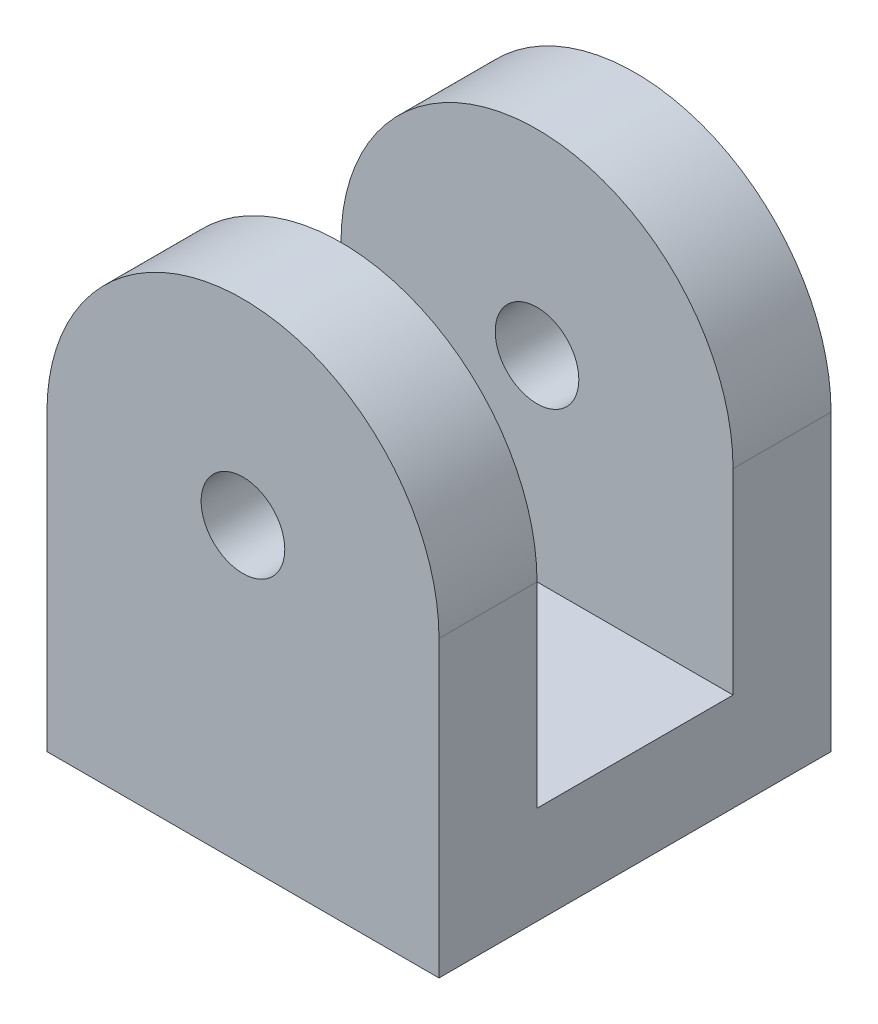
ISO-10303-21;
HEADER;
FILE_DESCRIPTION(('STEP AP214'),'2;1');
FILE_NAME('part.step','',(''),(''),'','','');
FILE_SCHEMA(('AUTOMOTIVE_DESIGN { 1 0 10303 214 1 1 1 1 }'));
ENDSEC;
DATA;
#1=APPLICATION_CONTEXT('core data for automotive mechanical design processes');
#2=APPLICATION_PROTOCOL_DEFINITION('international standard','automotive_design',2000,#1);
#3=PRODUCT_CONTEXT('',#1,'mechanical');
#4=PRODUCT('Part','Part','',(#3));
#5=PRODUCT_RELATED_PRODUCT_CATEGORY('part','',(#4));
#6=PRODUCT_DEFINITION_FORMATION('','',#4);
#7=PRODUCT_DEFINITION_CONTEXT('part definition',#1,'design');
#8=PRODUCT_DEFINITION('design','',#6,#7);
#9=PRODUCT_DEFINITION_SHAPE('','',#8);
#10=(LENGTH_UNIT() NAMED_UNIT(*) SI_UNIT(.MILLI.,.METRE.));
#11=(NAMED_UNIT(*) PLANE_ANGLE_UNIT() SI_UNIT($,.RADIAN.));
#12=(NAMED_UNIT(*) SI_UNIT($,.STERADIAN.) SOLID_ANGLE_UNIT());
#13=UNCERTAINTY_MEASURE_WITH_UNIT(LENGTH_MEASURE(1.E-05),#10,'distance_accuracy_value','');
#14=(GEOMETRIC_REPRESENTATION_CONTEXT(3) GLOBAL_UNCERTAINTY_ASSIGNED_CONTEXT((#13)) GLOBAL_UNIT_ASSIGNED_CONTEXT((#10,
#11,#12)) REPRESENTATION_CONTEXT('',''));
#15=CARTESIAN_POINT('',(0.,0.,0.));
#16=DIRECTION('',(0.,0.,1.));
#17=DIRECTION('',(1.,0.,0.));
#18=AXIS2_PLACEMENT_3D('',#15,#16,#17);
#19=CARTESIAN_POINT('',(0.,0.,7.5));
#20=DIRECTION('',(0.,0.,-1.));
#21=DIRECTION('',(-1.,0.,0.));
#22=AXIS2_PLACEMENT_3D('',#19,#20,#21);
#23=PLANE('',#22);
#24=CARTESIAN_POINT('',(0.,9.375,7.5));
#25=DIRECTION('',(0.,0.,-1.));
#26=DIRECTION('',(-1.,0.,0.));
#27=AXIS2_PLACEMENT_3D('',#24,#25,#26);
#28=CIRCLE('',#27,1.6);
#29=CARTESIAN_POINT('',(1.6,9.375,7.5));
#30=VERTEX_POINT('',#29);
#31=EDGE_CURVE('E238',#30,#30,#28,.T.);
#32=ORIENTED_EDGE('',*,*,#31,.T.);
#33=EDGE_LOOP('',(#32));
#34=FACE_BOUND('',#33,.T.);
#35=CARTESIAN_POINT('',(0.,9.375,7.5));
#36=DIRECTION('',(0.,0.,1.));
#37=DIRECTION('',(1.,0.,0.));
#38=AXIS2_PLACEMENT_3D('',#35,#36,#37);
#39=CIRCLE('',#38,7.5);
#40=CARTESIAN_POINT('',(7.5,9.375,7.5));
#41=VERTEX_POINT('',#40);
#42=CARTESIAN_POINT('',(-7.5,9.375,7.5));
#43=VERTEX_POINT('',#42);
#44=EDGE_CURVE('E121',#41,#43,#39,.T.);
#45=ORIENTED_EDGE('',*,*,#44,.T.);
#46=DIRECTION('',(0.,-1.,0.));
#47=VECTOR('',#46,1.);
#48=CARTESIAN_POINT('',(-7.5,-1.875,7.5));
#49=LINE('',#48,#47);
#50=CARTESIAN_POINT('',(-7.5,-1.875,7.5));
#51=VERTEX_POINT('',#50);
#52=EDGE_CURVE('E165',#43,#51,#49,.T.);
#53=ORIENTED_EDGE('',*,*,#52,.T.);
#54=DIRECTION('',(1.,0.,0.));
#55=VECTOR('',#54,1.);
#56=CARTESIAN_POINT('',(-7.5,-1.875,7.5));
#57=LINE('',#56,#55);
#58=CARTESIAN_POINT('',(7.5,-1.875,7.5));
#59=VERTEX_POINT('',#58);
#60=EDGE_CURVE('E169',#51,#59,#57,.T.);
#61=ORIENTED_EDGE('',*,*,#60,.T.);
#62=DIRECTION('',(0.,1.,0.));
#63=VECTOR('',#62,1.);
#64=CARTESIAN_POINT('',(7.5,-1.875,7.5));
#65=LINE('',#64,#63);
#66=EDGE_CURVE('E172',#59,#41,#65,.T.);
#67=ORIENTED_EDGE('',*,*,#66,.T.);
#68=EDGE_LOOP('',(#45,#53,#61,#67));
#69=FACE_BOUND('',#68,.T.);
#70=ADVANCED_FACE('F117',(#34,#69),#23,.F.);
#71=CARTESIAN_POINT('',(-7.5,16.875,3.75));
#72=DIRECTION('',(0.,0.,1.));
#73=DIRECTION('',(1.,0.,0.));
#74=AXIS2_PLACEMENT_3D('',#71,#72,#73);
#75=PLANE('',#74);
#76=CARTESIAN_POINT('',(0.,9.375,3.75));
#77=DIRECTION('',(0.,0.,1.));
#78=DIRECTION('',(1.,0.,0.));
#79=AXIS2_PLACEMENT_3D('',#76,#77,#78);
#80=CIRCLE('',#79,1.6);
#81=CARTESIAN_POINT('',(1.6,9.375,3.75));
#82=VERTEX_POINT('',#81);
#83=EDGE_CURVE('E231',#82,#82,#80,.F.);
#84=ORIENTED_EDGE('',*,*,#83,.F.);
#85=EDGE_LOOP('',(#84));
#86=FACE_BOUND('',#85,.T.);
#87=DIRECTION('',(0.,-1.,0.));
#88=VECTOR('',#87,1.);
#89=CARTESIAN_POINT('',(-7.5,16.875,3.75));
#90=LINE('',#89,#88);
#91=CARTESIAN_POINT('',(-7.5,9.375,3.75));
#92=VERTEX_POINT('',#91);
#93=CARTESIAN_POINT('',(-7.5,1.875,3.75));
#94=VERTEX_POINT('',#93);
#95=EDGE_CURVE('E203',#92,#94,#90,.T.);
#96=ORIENTED_EDGE('',*,*,#95,.F.);
#97=CARTESIAN_POINT('',(0.,9.375,3.75));
#98=DIRECTION('',(0.,0.,1.));
#99=DIRECTION('',(1.,0.,0.));
#100=AXIS2_PLACEMENT_3D('',#97,#98,#99);
#101=CIRCLE('',#100,7.5);
#102=CARTESIAN_POINT('',(7.5,9.375,3.75));
#103=VERTEX_POINT('',#102);
#104=EDGE_CURVE('E154',#92,#103,#101,.F.);
#105=ORIENTED_EDGE('',*,*,#104,.T.);
#106=DIRECTION('',(0.,-1.,0.));
#107=VECTOR('',#106,1.);
#108=CARTESIAN_POINT('',(7.5,16.875,3.75));
#109=LINE('',#108,#107);
#110=CARTESIAN_POINT('',(7.5,1.875,3.75));
#111=VERTEX_POINT('',#110);
#112=EDGE_CURVE('E135',#103,#111,#109,.T.);
#113=ORIENTED_EDGE('',*,*,#112,.T.);
#114=DIRECTION('',(-1.,0.,0.));
#115=VECTOR('',#114,1.);
#116=CARTESIAN_POINT('',(-7.5,1.875,3.75));
#117=LINE('',#116,#115);
#118=EDGE_CURVE('E244',#111,#94,#117,.T.);
#119=ORIENTED_EDGE('',*,*,#118,.T.);
#120=EDGE_LOOP('',(#96,#105,#113,#119));
#121=FACE_BOUND('',#120,.T.);
#122=ADVANCED_FACE('F250',(#86,#121),#75,.F.);
#123=CARTESIAN_POINT('',(-7.5,-1.875,7.5));
#124=DIRECTION('',(1.,0.,0.));
#125=DIRECTION('',(0.,0.,-1.));
#126=AXIS2_PLACEMENT_3D('',#123,#124,#125);
#127=PLANE('',#126);
#128=DIRECTION('',(0.,0.,1.));
#129=VECTOR('',#128,1.);
#130=CARTESIAN_POINT('',(-7.5,9.375,-6.85660171779821));
#131=LINE('',#130,#129);
#132=EDGE_CURVE('E236',#92,#43,#131,.T.);
#133=ORIENTED_EDGE('',*,*,#132,.F.);
#134=ORIENTED_EDGE('',*,*,#95,.T.);
#135=DIRECTION('',(0.,0.,-1.));
#136=VECTOR('',#135,1.);
#137=CARTESIAN_POINT('',(-7.5,1.875,7.5));
#138=LINE('',#137,#136);
#139=CARTESIAN_POINT('',(-7.5,1.875,-3.75));
#140=VERTEX_POINT('',#139);
#141=EDGE_CURVE('E127',#94,#140,#138,.T.);
#142=ORIENTED_EDGE('',*,*,#141,.T.);
#143=DIRECTION('',(0.,-1.,0.));
#144=VECTOR('',#143,1.);
#145=CARTESIAN_POINT('',(-7.5,16.875,-3.75));
#146=LINE('',#145,#144);
#147=CARTESIAN_POINT('',(-7.5,9.375,-3.75));
#148=VERTEX_POINT('',#147);
#149=EDGE_CURVE('E201',#148,#140,#146,.T.);
#150=ORIENTED_EDGE('',*,*,#149,.F.);
#151=DIRECTION('',(0.,0.,-1.));
#152=VECTOR('',#151,1.);
#153=CARTESIAN_POINT('',(-7.5,9.375,6.85660171779821));
#154=LINE('',#153,#152);
#155=CARTESIAN_POINT('',(-7.5,9.375,-7.5));
#156=VERTEX_POINT('',#155);
#157=EDGE_CURVE('E262',#148,#156,#154,.T.);
#158=ORIENTED_EDGE('',*,*,#157,.T.);
#159=DIRECTION('',(0.,-1.,0.));
#160=VECTOR('',#159,1.);
#161=CARTESIAN_POINT('',(-7.5,-1.875,-7.5));
#162=LINE('',#161,#160);
#163=CARTESIAN_POINT('',(-7.5,-1.875,-7.5));
#164=VERTEX_POINT('',#163);
#165=EDGE_CURVE('E181',#156,#164,#162,.T.);
#166=ORIENTED_EDGE('',*,*,#165,.T.);
#167=DIRECTION('',(0.,0.,-1.));
#168=VECTOR('',#167,1.);
#169=CARTESIAN_POINT('',(-7.5,-1.875,7.5));
#170=LINE('',#169,#168);
#171=EDGE_CURVE('E176',#51,#164,#170,.T.);
#172=ORIENTED_EDGE('',*,*,#171,.F.);
#173=ORIENTED_EDGE('',*,*,#52,.F.);
#174=EDGE_LOOP('',(#133,#134,#142,#150,#158,#166,#172,#173));
#175=FACE_BOUND('',#174,.T.);
#176=ADVANCED_FACE('F177',(#175),#127,.F.);
#177=CARTESIAN_POINT('',(-7.5,1.875,7.5));
#178=DIRECTION('',(0.,-1.,0.));
#179=DIRECTION('',(0.,0.,-1.));
#180=AXIS2_PLACEMENT_3D('',#177,#178,#179);
#181=PLANE('',#180);
#182=ORIENTED_EDGE('',*,*,#118,.F.);
#183=DIRECTION('',(0.,0.,-1.));
#184=VECTOR('',#183,1.);
#185=CARTESIAN_POINT('',(7.5,1.875,7.5));
#186=LINE('',#185,#184);
#187=CARTESIAN_POINT('',(7.5,1.875,-3.75));
#188=VERTEX_POINT('',#187);
#189=EDGE_CURVE('E12',#111,#188,#186,.T.);
#190=ORIENTED_EDGE('',*,*,#189,.T.);
#191=DIRECTION('',(-1.,0.,0.));
#192=VECTOR('',#191,1.);
#193=CARTESIAN_POINT('',(-7.5,1.875,-3.75));
#194=LINE('',#193,#192);
#195=EDGE_CURVE('E208',#188,#140,#194,.T.);
#196=ORIENTED_EDGE('',*,*,#195,.T.);
#197=ORIENTED_EDGE('',*,*,#141,.F.);
#198=EDGE_LOOP('',(#182,#190,#196,#197));
#199=FACE_BOUND('',#198,.T.);
#200=ADVANCED_FACE('F209',(#199),#181,.F.);
#201=CARTESIAN_POINT('',(7.5,-1.875,7.5));
#202=DIRECTION('',(-1.,0.,0.));
#203=DIRECTION('',(0.,0.,1.));
#204=AXIS2_PLACEMENT_3D('',#201,#202,#203);
#205=PLANE('',#204);
#206=ORIENTED_EDGE('',*,*,#112,.F.);
#207=DIRECTION('',(0.,0.,1.));
#208=VECTOR('',#207,1.);
#209=CARTESIAN_POINT('',(7.5,9.375,-6.85660171779821));
#210=LINE('',#209,#208);
#211=EDGE_CURVE('E241',#103,#41,#210,.T.);
#212=ORIENTED_EDGE('',*,*,#211,.T.);
#213=ORIENTED_EDGE('',*,*,#66,.F.);
#214=DIRECTION('',(0.,0.,-1.));
#215=VECTOR('',#214,1.);
#216=CARTESIAN_POINT('',(7.5,-1.875,7.5));
#217=LINE('',#216,#215);
#218=CARTESIAN_POINT('',(7.5,-1.875,-7.5));
#219=VERTEX_POINT('',#218);
#220=EDGE_CURVE('E185',#59,#219,#217,.T.);
#221=ORIENTED_EDGE('',*,*,#220,.T.);
#222=DIRECTION('',(0.,1.,0.));
#223=VECTOR('',#222,1.);
#224=CARTESIAN_POINT('',(7.5,-1.875,-7.5));
#225=LINE('',#224,#223);
#226=CARTESIAN_POINT('',(7.5,9.375,-7.5));
#227=VERTEX_POINT('',#226);
#228=EDGE_CURVE('E222',#219,#227,#225,.T.);
#229=ORIENTED_EDGE('',*,*,#228,.T.);
#230=DIRECTION('',(0.,0.,-1.));
#231=VECTOR('',#230,1.);
#232=CARTESIAN_POINT('',(7.5,9.375,6.85660171779821));
#233=LINE('',#232,#231);
#234=CARTESIAN_POINT('',(7.5,9.375,-3.75));
#235=VERTEX_POINT('',#234);
#236=EDGE_CURVE('E253',#235,#227,#233,.T.);
#237=ORIENTED_EDGE('',*,*,#236,.F.);
#238=DIRECTION('',(0.,-1.,0.));
#239=VECTOR('',#238,1.);
#240=CARTESIAN_POINT('',(7.5,16.875,-3.75));
#241=LINE('',#240,#239);
#242=EDGE_CURVE('E220',#235,#188,#241,.T.);
#243=ORIENTED_EDGE('',*,*,#242,.T.);
#244=ORIENTED_EDGE('',*,*,#189,.F.);
#245=EDGE_LOOP('',(#206,#212,#213,#221,#229,#237,#243,#244));
#246=FACE_BOUND('',#245,.T.);
#247=ADVANCED_FACE('F119',(#246),#205,.F.);
#248=CARTESIAN_POINT('',(-7.5,-1.875,7.5));
#249=DIRECTION('',(0.,1.,0.));
#250=DIRECTION('',(0.,0.,1.));
#251=AXIS2_PLACEMENT_3D('',#248,#249,#250);
#252=PLANE('',#251);
#253=ORIENTED_EDGE('',*,*,#171,.T.);
#254=DIRECTION('',(1.,0.,0.));
#255=VECTOR('',#254,1.);
#256=CARTESIAN_POINT('',(-7.5,-1.875,-7.5));
#257=LINE('',#256,#255);
#258=EDGE_CURVE('E229',#164,#219,#257,.T.);
#259=ORIENTED_EDGE('',*,*,#258,.T.);
#260=ORIENTED_EDGE('',*,*,#220,.F.);
#261=ORIENTED_EDGE('',*,*,#60,.F.);
#262=EDGE_LOOP('',(#253,#259,#260,#261));
#263=FACE_BOUND('',#262,.T.);
#264=ADVANCED_FACE('F187',(#263),#252,.F.);
#265=CARTESIAN_POINT('',(0.,9.375,-6.85660171779821));
#266=DIRECTION('',(0.,0.,1.));
#267=DIRECTION('',(1.,0.,0.));
#268=AXIS2_PLACEMENT_3D('',#265,#266,#267);
#269=CYLINDRICAL_SURFACE('',#268,7.5);
#270=ORIENTED_EDGE('',*,*,#44,.F.);
#271=ORIENTED_EDGE('',*,*,#211,.F.);
#272=ORIENTED_EDGE('',*,*,#104,.F.);
#273=ORIENTED_EDGE('',*,*,#132,.T.);
#274=EDGE_LOOP('',(#270,#271,#272,#273));
#275=FACE_BOUND('',#274,.T.);
#276=ADVANCED_FACE('F249',(#275),#269,.T.);
#277=CARTESIAN_POINT('',(0.,9.375,-6.85660171779821));
#278=DIRECTION('',(0.,0.,1.));
#279=DIRECTION('',(1.,0.,0.));
#280=AXIS2_PLACEMENT_3D('',#277,#278,#279);
#281=CYLINDRICAL_SURFACE('',#280,1.6);
#282=CARTESIAN_POINT('',(1.6,9.375,3.75));
#283=CARTESIAN_POINT('',(1.6,9.375,3.7890625));
#284=CARTESIAN_POINT('',(1.6,9.375,3.828125));
#285=CARTESIAN_POINT('',(1.6,9.375,3.90625));
#286=CARTESIAN_POINT('',(1.6,9.375,3.9453125));
#287=CARTESIAN_POINT('',(1.6,9.375,4.0234375));
#288=CARTESIAN_POINT('',(1.6,9.375,4.0625));
#289=CARTESIAN_POINT('',(1.6,9.375,4.140625));
#290=CARTESIAN_POINT('',(1.6,9.375,4.1796875));
#291=CARTESIAN_POINT('',(1.6,9.375,4.2578125));
#292=CARTESIAN_POINT('',(1.6,9.375,4.296875));
#293=CARTESIAN_POINT('',(1.6,9.375,4.375));
#294=CARTESIAN_POINT('',(1.6,9.375,4.4140625));
#295=CARTESIAN_POINT('',(1.6,9.375,4.4921875));
#296=CARTESIAN_POINT('',(1.6,9.375,4.53125));
#297=CARTESIAN_POINT('',(1.6,9.375,4.609375));
#298=CARTESIAN_POINT('',(1.6,9.375,4.6484375));
#299=CARTESIAN_POINT('',(1.6,9.375,4.7265625));
#300=CARTESIAN_POINT('',(1.6,9.375,4.765625));
#301=CARTESIAN_POINT('',(1.6,9.375,4.84375));
#302=CARTESIAN_POINT('',(1.6,9.375,4.8828125));
#303=CARTESIAN_POINT('',(1.6,9.375,4.9609375));
#304=CARTESIAN_POINT('',(1.6,9.375,5.));
#305=CARTESIAN_POINT('',(1.6,9.375,5.078125));
#306=CARTESIAN_POINT('',(1.6,9.375,5.1171875));
#307=CARTESIAN_POINT('',(1.6,9.375,5.1953125));
#308=CARTESIAN_POINT('',(1.6,9.375,5.234375));
#309=CARTESIAN_POINT('',(1.6,9.375,5.3125));
#310=CARTESIAN_POINT('',(1.6,9.375,5.3515625));
#311=CARTESIAN_POINT('',(1.6,9.375,5.4296875));
#312=CARTESIAN_POINT('',(1.6,9.375,5.46875));
#313=CARTESIAN_POINT('',(1.6,9.375,5.546875));
#314=CARTESIAN_POINT('',(1.6,9.375,5.5859375));
#315=CARTESIAN_POINT('',(1.6,9.375,5.6640625));
#316=CARTESIAN_POINT('',(1.6,9.375,5.703125));
#317=CARTESIAN_POINT('',(1.6,9.375,5.78125));
#318=CARTESIAN_POINT('',(1.6,9.375,5.8203125));
#319=CARTESIAN_POINT('',(1.6,9.375,5.8984375));
#320=CARTESIAN_POINT('',(1.6,9.375,5.9375));
#321=CARTESIAN_POINT('',(1.6,9.375,6.015625));
#322=CARTESIAN_POINT('',(1.6,9.375,6.0546875));
#323=CARTESIAN_POINT('',(1.6,9.375,6.1328125));
#324=CARTESIAN_POINT('',(1.6,9.375,6.171875));
#325=CARTESIAN_POINT('',(1.6,9.375,6.25));
#326=CARTESIAN_POINT('',(1.6,9.375,6.2890625));
#327=CARTESIAN_POINT('',(1.6,9.375,6.3671875));
#328=CARTESIAN_POINT('',(1.6,9.375,6.40625));
#329=CARTESIAN_POINT('',(1.6,9.375,6.484375));
#330=CARTESIAN_POINT('',(1.6,9.375,6.5234375));
#331=CARTESIAN_POINT('',(1.6,9.375,6.6015625));
#332=CARTESIAN_POINT('',(1.6,9.375,6.640625));
#333=CARTESIAN_POINT('',(1.6,9.375,6.71875));
#334=CARTESIAN_POINT('',(1.6,9.375,6.7578125));
#335=CARTESIAN_POINT('',(1.6,9.375,6.8359375));
#336=CARTESIAN_POINT('',(1.6,9.375,6.875));
#337=CARTESIAN_POINT('',(1.6,9.375,6.953125));
#338=CARTESIAN_POINT('',(1.6,9.375,6.9921875));
#339=CARTESIAN_POINT('',(1.6,9.375,7.0703125));
#340=CARTESIAN_POINT('',(1.6,9.375,7.109375));
#341=CARTESIAN_POINT('',(1.6,9.375,7.1875));
#342=CARTESIAN_POINT('',(1.6,9.375,7.2265625));
#343=CARTESIAN_POINT('',(1.6,9.375,7.3046875));
#344=CARTESIAN_POINT('',(1.6,9.375,7.34375));
#345=CARTESIAN_POINT('',(1.6,9.375,7.421875));
#346=CARTESIAN_POINT('',(1.6,9.375,7.4609375));
#347=CARTESIAN_POINT('',(1.6,9.375,7.5));
#348=B_SPLINE_CURVE_WITH_KNOTS('',3,(#282,#283,#284,#285,#286,#287,#288,#289,#290,#291,#292,
#293,#294,#295,#296,#297,#298,#299,#300,#301,#302,#303,#304,#305,#306,#307,#308,#309,#310,#311,
#312,#313,#314,#315,#316,#317,#318,#319,#320,#321,#322,#323,#324,#325,#326,#327,#328,#329,#330,
#331,#332,#333,#334,#335,#336,#337,#338,#339,#340,#341,#342,#343,#344,#345,#346,#347),
.UNSPECIFIED.,.F.,.F.,(4,2,2,2,2,2,2,2,2,2,2,2,2,2,2,2,2,2,2,2,2,2,2,2,2,2,2,2,2,2,2,2,4),(0.,
0.117187500000001,0.234375,0.351562499999999,0.46875,0.585937500000001,0.703125000000001,
0.8203125,0.937500000000001,1.0546875,1.171875,1.2890625,1.40625,1.5234375,1.640625,1.7578125,
1.875,1.9921875,2.109375,2.2265625,2.34375,2.4609375,2.578125,2.6953125,2.8125,2.9296875,
3.046875,3.1640625,3.28125,3.3984375,3.515625,3.6328125,3.75),.UNSPECIFIED.);
#349=EDGE_CURVE('BSEAM286',#82,#30,#348,.T.);
#350=ORIENTED_EDGE('',*,*,#83,.T.);
#351=ORIENTED_EDGE('',*,*,#31,.F.);
#352=ORIENTED_EDGE('',*,*,#349,.T.);
#353=ORIENTED_EDGE('',*,*,#349,.F.);
#354=EDGE_LOOP('',(#350,#352,#351,#353));
#355=FACE_BOUND('',#354,.T.);
#356=ADVANCED_FACE('F286',(#355),#281,.F.);
#357=CARTESIAN_POINT('',(0.,0.,-7.5));
#358=DIRECTION('',(0.,0.,1.));
#359=DIRECTION('',(-1.,0.,0.));
#360=AXIS2_PLACEMENT_3D('',#357,#358,#359);
#361=PLANE('',#360);
#362=CARTESIAN_POINT('',(0.,9.375,-7.5));
#363=DIRECTION('',(0.,0.,-1.));
#364=DIRECTION('',(-1.,0.,0.));
#365=AXIS2_PLACEMENT_3D('',#362,#363,#364);
#366=CIRCLE('',#365,1.6);
#367=CARTESIAN_POINT('',(1.6,9.375,-7.5));
#368=VERTEX_POINT('',#367);
#369=EDGE_CURVE('E263',#368,#368,#366,.T.);
#370=ORIENTED_EDGE('',*,*,#369,.F.);
#371=EDGE_LOOP('',(#370));
#372=FACE_BOUND('',#371,.T.);
#373=CARTESIAN_POINT('',(0.,9.375,-7.5));
#374=DIRECTION('',(0.,0.,1.));
#375=DIRECTION('',(1.,0.,0.));
#376=AXIS2_PLACEMENT_3D('',#373,#374,#375);
#377=CIRCLE('',#376,7.5);
#378=EDGE_CURVE('E214',#227,#156,#377,.T.);
#379=ORIENTED_EDGE('',*,*,#378,.F.);
#380=ORIENTED_EDGE('',*,*,#228,.F.);
#381=ORIENTED_EDGE('',*,*,#258,.F.);
#382=ORIENTED_EDGE('',*,*,#165,.F.);
#383=EDGE_LOOP('',(#379,#380,#381,#382));
#384=FACE_BOUND('',#383,.T.);
#385=ADVANCED_FACE('F268',(#372,#384),#361,.F.);
#386=CARTESIAN_POINT('',(-7.5,16.875,-3.75));
#387=DIRECTION('',(0.,0.,-1.));
#388=DIRECTION('',(1.,0.,0.));
#389=AXIS2_PLACEMENT_3D('',#386,#387,#388);
#390=PLANE('',#389);
#391=CARTESIAN_POINT('',(0.,9.375,-3.75));
#392=DIRECTION('',(0.,0.,1.));
#393=DIRECTION('',(1.,0.,0.));
#394=AXIS2_PLACEMENT_3D('',#391,#392,#393);
#395=CIRCLE('',#394,1.6);
#396=CARTESIAN_POINT('',(1.6,9.375,-3.75));
#397=VERTEX_POINT('',#396);
#398=EDGE_CURVE('E264',#397,#397,#395,.F.);
#399=ORIENTED_EDGE('',*,*,#398,.T.);
#400=EDGE_LOOP('',(#399));
#401=FACE_BOUND('',#400,.T.);
#402=ORIENTED_EDGE('',*,*,#149,.T.);
#403=ORIENTED_EDGE('',*,*,#195,.F.);
#404=ORIENTED_EDGE('',*,*,#242,.F.);
#405=CARTESIAN_POINT('',(0.,9.375,-3.75));
#406=DIRECTION('',(0.,0.,1.));
#407=DIRECTION('',(1.,0.,0.));
#408=AXIS2_PLACEMENT_3D('',#405,#406,#407);
#409=CIRCLE('',#408,7.5);
#410=EDGE_CURVE('E219',#148,#235,#409,.F.);
#411=ORIENTED_EDGE('',*,*,#410,.F.);
#412=EDGE_LOOP('',(#402,#403,#404,#411));
#413=FACE_BOUND('',#412,.T.);
#414=ADVANCED_FACE('F217',(#401,#413),#390,.F.);
#415=CARTESIAN_POINT('',(0.,9.375,6.85660171779821));
#416=DIRECTION('',(0.,0.,-1.));
#417=DIRECTION('',(1.,0.,0.));
#418=AXIS2_PLACEMENT_3D('',#415,#416,#417);
#419=CYLINDRICAL_SURFACE('',#418,7.5);
#420=ORIENTED_EDGE('',*,*,#378,.T.);
#421=ORIENTED_EDGE('',*,*,#157,.F.);
#422=ORIENTED_EDGE('',*,*,#410,.T.);
#423=ORIENTED_EDGE('',*,*,#236,.T.);
#424=EDGE_LOOP('',(#420,#421,#422,#423));
#425=FACE_BOUND('',#424,.T.);
#426=ADVANCED_FACE('F270',(#425),#419,.T.);
#427=CARTESIAN_POINT('',(0.,9.375,6.85660171779821));
#428=DIRECTION('',(0.,0.,-1.));
#429=DIRECTION('',(1.,0.,0.));
#430=AXIS2_PLACEMENT_3D('',#427,#428,#429);
#431=CYLINDRICAL_SURFACE('',#430,1.6);
#432=CARTESIAN_POINT('',(1.6,9.375,-3.75));
#433=CARTESIAN_POINT('',(1.6,9.375,-3.7890625));
#434=CARTESIAN_POINT('',(1.6,9.375,-3.828125));
#435=CARTESIAN_POINT('',(1.6,9.375,-3.90625));
#436=CARTESIAN_POINT('',(1.6,9.375,-3.9453125));
#437=CARTESIAN_POINT('',(1.6,9.375,-4.0234375));
#438=CARTESIAN_POINT('',(1.6,9.375,-4.0625));
#439=CARTESIAN_POINT('',(1.6,9.375,-4.140625));
#440=CARTESIAN_POINT('',(1.6,9.375,-4.1796875));
#441=CARTESIAN_POINT('',(1.6,9.375,-4.2578125));
#442=CARTESIAN_POINT('',(1.6,9.375,-4.296875));
#443=CARTESIAN_POINT('',(1.6,9.375,-4.375));
#444=CARTESIAN_POINT('',(1.6,9.375,-4.4140625));
#445=CARTESIAN_POINT('',(1.6,9.375,-4.4921875));
#446=CARTESIAN_POINT('',(1.6,9.375,-4.53125));
#447=CARTESIAN_POINT('',(1.6,9.375,-4.609375));
#448=CARTESIAN_POINT('',(1.6,9.375,-4.6484375));
#449=CARTESIAN_POINT('',(1.6,9.375,-4.7265625));
#450=CARTESIAN_POINT('',(1.6,9.375,-4.765625));
#451=CARTESIAN_POINT('',(1.6,9.375,-4.84375));
#452=CARTESIAN_POINT('',(1.6,9.375,-4.8828125));
#453=CARTESIAN_POINT('',(1.6,9.375,-4.9609375));
#454=CARTESIAN_POINT('',(1.6,9.375,-5.));
#455=CARTESIAN_POINT('',(1.6,9.375,-5.078125));
#456=CARTESIAN_POINT('',(1.6,9.375,-5.1171875));
#457=CARTESIAN_POINT('',(1.6,9.375,-5.1953125));
#458=CARTESIAN_POINT('',(1.6,9.375,-5.234375));
#459=CARTESIAN_POINT('',(1.6,9.375,-5.3125));
#460=CARTESIAN_POINT('',(1.6,9.375,-5.3515625));
#461=CARTESIAN_POINT('',(1.6,9.375,-5.4296875));
#462=CARTESIAN_POINT('',(1.6,9.375,-5.46875));
#463=CARTESIAN_POINT('',(1.6,9.375,-5.546875));
#464=CARTESIAN_POINT('',(1.6,9.375,-5.5859375));
#465=CARTESIAN_POINT('',(1.6,9.375,-5.6640625));
#466=CARTESIAN_POINT('',(1.6,9.375,-5.703125));
#467=CARTESIAN_POINT('',(1.6,9.375,-5.78125));
#468=CARTESIAN_POINT('',(1.6,9.375,-5.8203125));
#469=CARTESIAN_POINT('',(1.6,9.375,-5.8984375));
#470=CARTESIAN_POINT('',(1.6,9.375,-5.9375));
#471=CARTESIAN_POINT('',(1.6,9.375,-6.015625));
#472=CARTESIAN_POINT('',(1.6,9.375,-6.0546875));
#473=CARTESIAN_POINT('',(1.6,9.375,-6.1328125));
#474=CARTESIAN_POINT('',(1.6,9.375,-6.171875));
#475=CARTESIAN_POINT('',(1.6,9.375,-6.25));
#476=CARTESIAN_POINT('',(1.6,9.375,-6.2890625));
#477=CARTESIAN_POINT('',(1.6,9.375,-6.3671875));
#478=CARTESIAN_POINT('',(1.6,9.375,-6.40625));
#479=CARTESIAN_POINT('',(1.6,9.375,-6.484375));
#480=CARTESIAN_POINT('',(1.6,9.375,-6.5234375));
#481=CARTESIAN_POINT('',(1.6,9.375,-6.6015625));
#482=CARTESIAN_POINT('',(1.6,9.375,-6.640625));
#483=CARTESIAN_POINT('',(1.6,9.375,-6.71875));
#484=CARTESIAN_POINT('',(1.6,9.375,-6.7578125));
#485=CARTESIAN_POINT('',(1.6,9.375,-6.8359375));
#486=CARTESIAN_POINT('',(1.6,9.375,-6.875));
#487=CARTESIAN_POINT('',(1.6,9.375,-6.953125));
#488=CARTESIAN_POINT('',(1.6,9.375,-6.9921875));
#489=CARTESIAN_POINT('',(1.6,9.375,-7.0703125));
#490=CARTESIAN_POINT('',(1.6,9.375,-7.109375));
#491=CARTESIAN_POINT('',(1.6,9.375,-7.1875));
#492=CARTESIAN_POINT('',(1.6,9.375,-7.2265625));
#493=CARTESIAN_POINT('',(1.6,9.375,-7.3046875));
#494=CARTESIAN_POINT('',(1.6,9.375,-7.34375));
#495=CARTESIAN_POINT('',(1.6,9.375,-7.421875));
#496=CARTESIAN_POINT('',(1.6,9.375,-7.4609375));
#497=CARTESIAN_POINT('',(1.6,9.375,-7.5));
#498=B_SPLINE_CURVE_WITH_KNOTS('',3,(#432,#433,#434,#435,#436,#437,#438,#439,#440,#441,#442,
#443,#444,#445,#446,#447,#448,#449,#450,#451,#452,#453,#454,#455,#456,#457,#458,#459,#460,#461,
#462,#463,#464,#465,#466,#467,#468,#469,#470,#471,#472,#473,#474,#475,#476,#477,#478,#479,#480,
#481,#482,#483,#484,#485,#486,#487,#488,#489,#490,#491,#492,#493,#494,#495,#496,#497),
.UNSPECIFIED.,.F.,.F.,(4,2,2,2,2,2,2,2,2,2,2,2,2,2,2,2,2,2,2,2,2,2,2,2,2,2,2,2,2,2,2,2,4),(0.,
0.117187499999999,0.234375,0.351562499999999,0.46875,0.5859375,0.703124999999999,0.8203125,
0.937499999999999,1.0546875,1.171875,1.2890625,1.40625,1.5234375,1.640625,1.7578125,1.875,
1.9921875,2.109375,2.2265625,2.34375,2.4609375,2.578125,2.6953125,2.8125,2.9296875,3.046875,
3.1640625,3.28125,3.3984375,3.515625,3.6328125,3.75),.UNSPECIFIED.);
#499=EDGE_CURVE('BSEAM279',#397,#368,#498,.T.);
#500=ORIENTED_EDGE('',*,*,#398,.F.);
#501=ORIENTED_EDGE('',*,*,#369,.T.);
#502=ORIENTED_EDGE('',*,*,#499,.T.);
#503=ORIENTED_EDGE('',*,*,#499,.F.);
#504=EDGE_LOOP('',(#500,#502,#501,#503));
#505=FACE_BOUND('',#504,.T.);
#506=ADVANCED_FACE('F279',(#505),#431,.F.);
#507=CLOSED_SHELL('',(#70,#122,#176,#200,#247,#264,#276,#356,#385,#414,#426,#506));
#508=MANIFOLD_SOLID_BREP('B2',#507);
#509=ADVANCED_BREP_SHAPE_REPRESENTATION('',(#18,#508),#14);
#510=SHAPE_DEFINITION_REPRESENTATION(#9,#509);
ENDSEC;
END-ISO-10303-21;
